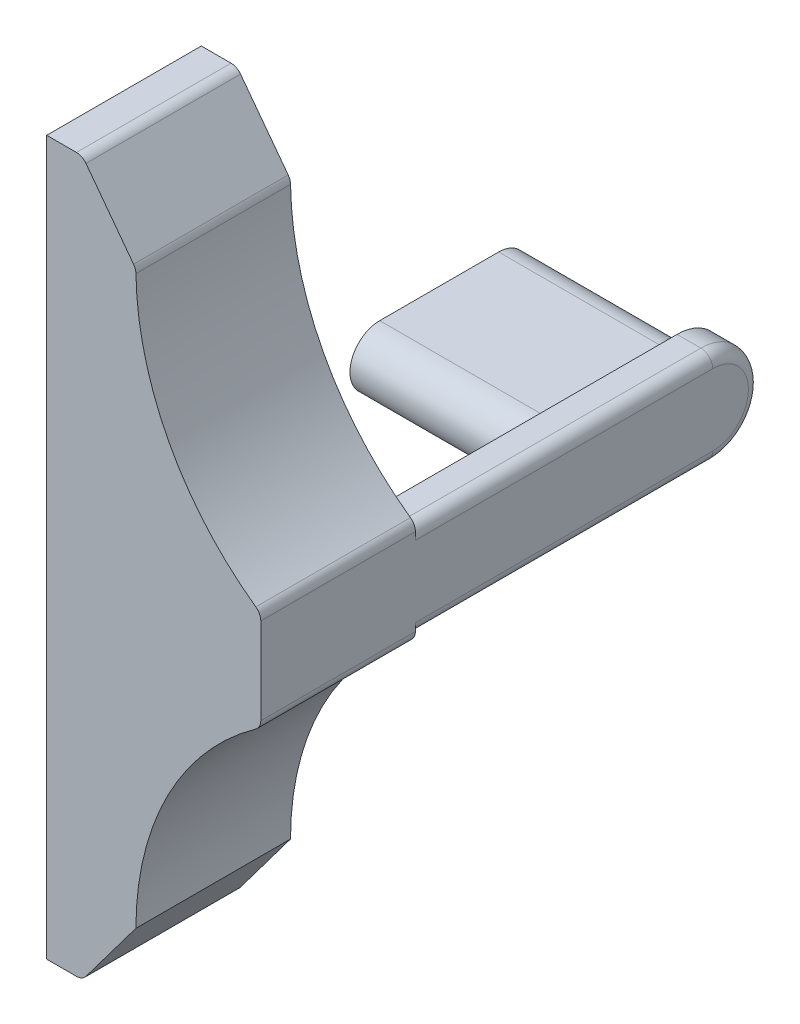
ISO-10303-21;
HEADER;
FILE_DESCRIPTION(('STEP AP214'),'2;1');
FILE_NAME('part.step','',(''),(''),'','','');
FILE_SCHEMA(('AUTOMOTIVE_DESIGN { 1 0 10303 214 1 1 1 1 }'));
ENDSEC;
DATA;
#1=APPLICATION_CONTEXT('core data for automotive mechanical design processes');
#2=APPLICATION_PROTOCOL_DEFINITION('international standard','automotive_design',2000,#1);
#3=PRODUCT_CONTEXT('',#1,'mechanical');
#4=PRODUCT('Part','Part','',(#3));
#5=PRODUCT_RELATED_PRODUCT_CATEGORY('part','',(#4));
#6=PRODUCT_DEFINITION_FORMATION('','',#4);
#7=PRODUCT_DEFINITION_CONTEXT('part definition',#1,'design');
#8=PRODUCT_DEFINITION('design','',#6,#7);
#9=PRODUCT_DEFINITION_SHAPE('','',#8);
#10=(LENGTH_UNIT() NAMED_UNIT(*) SI_UNIT(.MILLI.,.METRE.));
#11=(NAMED_UNIT(*) PLANE_ANGLE_UNIT() SI_UNIT($,.RADIAN.));
#12=(NAMED_UNIT(*) SI_UNIT($,.STERADIAN.) SOLID_ANGLE_UNIT());
#13=UNCERTAINTY_MEASURE_WITH_UNIT(LENGTH_MEASURE(1.E-05),#10,'distance_accuracy_value','');
#14=(GEOMETRIC_REPRESENTATION_CONTEXT(3) GLOBAL_UNCERTAINTY_ASSIGNED_CONTEXT((#13)) GLOBAL_UNIT_ASSIGNED_CONTEXT((#10,
#11,#12)) REPRESENTATION_CONTEXT('',''));
#15=CARTESIAN_POINT('',(0.,0.,0.));
#16=DIRECTION('',(0.,0.,1.));
#17=DIRECTION('',(1.,0.,0.));
#18=AXIS2_PLACEMENT_3D('',#15,#16,#17);
#19=CARTESIAN_POINT('',(7.27889970519868E-12,1.11022302462516E-13,-559.301234579366));
#20=DIRECTION('',(-1.,0.,0.));
#21=DIRECTION('',(0.,0.,1.));
#22=AXIS2_PLACEMENT_3D('',#19,#20,#21);
#23=PLANE('',#22);
#24=DIRECTION('',(0.,0.,-1.));
#25=VECTOR('',#24,1.);
#26=CARTESIAN_POINT('',(9.15240105925363E-12,86.2440750856868,-1.00000000000432));
#27=LINE('',#26,#25);
#28=CARTESIAN_POINT('',(9.15240105925363E-12,86.2440750856868,0.));
#29=VERTEX_POINT('',#28);
#30=CARTESIAN_POINT('',(9.15562617895288E-12,86.2440750856868,-24.9999999999957));
#31=VERTEX_POINT('',#30);
#32=EDGE_CURVE('E235',#29,#31,#27,.T.);
#33=ORIENTED_EDGE('',*,*,#32,.F.);
#34=DIRECTION('',(0.,1.,0.));
#35=VECTOR('',#34,1.);
#36=CARTESIAN_POINT('',(8.71872019025943E-12,66.244075085687,0.));
#37=LINE('',#36,#35);
#38=CARTESIAN_POINT('',(9.32758369762029E-12,94.2440750856868,0.));
#39=VERTEX_POINT('',#38);
#40=EDGE_CURVE('E291',#29,#39,#37,.T.);
#41=ORIENTED_EDGE('',*,*,#40,.T.);
#42=DIRECTION('',(0.,0.,1.));
#43=VECTOR('',#42,1.);
#44=CARTESIAN_POINT('',(9.32587340685131E-12,94.2440750856868,-1.00000000000432));
#45=LINE('',#44,#43);
#46=CARTESIAN_POINT('',(9.15240105925363E-12,94.2440750856868,-24.9999999999957));
#47=VERTEX_POINT('',#46);
#48=EDGE_CURVE('E238',#47,#39,#45,.T.);
#49=ORIENTED_EDGE('',*,*,#48,.F.);
#50=CARTESIAN_POINT('',(9.24260668000443E-12,90.2440750856868,-24.9999999999957));
#51=DIRECTION('',(-1.,0.,0.));
#52=DIRECTION('',(0.,-1.,0.));
#53=AXIS2_PLACEMENT_3D('',#50,#51,#52);
#54=CIRCLE('',#53,4.);
#55=EDGE_CURVE('E217',#31,#47,#54,.F.);
#56=ORIENTED_EDGE('',*,*,#55,.F.);
#57=EDGE_LOOP('',(#33,#41,#49,#56));
#58=FACE_BOUND('',#57,.T.);
#59=DIRECTION('',(0.,0.,1.));
#60=VECTOR('',#59,1.);
#61=CARTESIAN_POINT('',(1.90800590381451E-12,87.7440750856868,-24.9999999999957));
#62=LINE('',#61,#60);
#63=CARTESIAN_POINT('',(1.90800590381451E-12,87.7440750856868,-24.9999999999957));
#64=VERTEX_POINT('',#63);
#65=CARTESIAN_POINT('',(1.90800590381451E-12,87.7440750856868,-14.9999999999957));
#66=VERTEX_POINT('',#65);
#67=EDGE_CURVE('E230',#64,#66,#62,.T.);
#68=ORIENTED_EDGE('',*,*,#67,.F.);
#69=CARTESIAN_POINT('',(1.96236871697173E-12,90.2440750856868,-24.9999999999957));
#70=DIRECTION('',(-1.,0.,0.));
#71=DIRECTION('',(0.,-1.,0.));
#72=AXIS2_PLACEMENT_3D('',#69,#70,#71);
#73=CIRCLE('',#72,2.5);
#74=CARTESIAN_POINT('',(2.01673153012895E-12,92.7440750856868,-24.9999999999957));
#75=VERTEX_POINT('',#74);
#76=EDGE_CURVE('E224',#75,#64,#73,.T.);
#77=ORIENTED_EDGE('',*,*,#76,.F.);
#78=DIRECTION('',(0.,0.,-1.));
#79=VECTOR('',#78,1.);
#80=CARTESIAN_POINT('',(2.01673153012895E-12,92.7440750856868,-14.9999999999957));
#81=LINE('',#80,#79);
#82=CARTESIAN_POINT('',(9.29563123532762E-12,92.7440750856868,-14.9999999999957));
#83=VERTEX_POINT('',#82);
#84=EDGE_CURVE('E203',#83,#75,#81,.T.);
#85=ORIENTED_EDGE('',*,*,#84,.F.);
#86=CARTESIAN_POINT('',(1.96236871697173E-12,90.2440750856868,-14.9999999999957));
#87=DIRECTION('',(-1.,0.,0.));
#88=DIRECTION('',(0.,-1.,0.));
#89=AXIS2_PLACEMENT_3D('',#86,#87,#88);
#90=CIRCLE('',#89,2.5);
#91=EDGE_CURVE('E199',#66,#83,#90,.T.);
#92=ORIENTED_EDGE('',*,*,#91,.F.);
#93=EDGE_LOOP('',(#68,#77,#85,#92));
#94=FACE_BOUND('',#93,.T.);
#95=ADVANCED_FACE('F38',(#58,#94),#23,.T.);
#96=CARTESIAN_POINT('',(16.4999999999923,66.2440750856866,13.));
#97=DIRECTION('',(0.,0.,-1.));
#98=DIRECTION('',(-1.,0.,0.));
#99=AXIS2_PLACEMENT_3D('',#96,#97,#98);
#100=CYLINDRICAL_SURFACE('',#99,24.);
#101=CARTESIAN_POINT('',(16.4999999999923,66.2440750856866,0.));
#102=DIRECTION('',(0.,0.,-1.));
#103=DIRECTION('',(-1.,0.,0.));
#104=AXIS2_PLACEMENT_3D('',#101,#102,#103);
#105=CIRCLE('',#104,24.);
#106=CARTESIAN_POINT('',(-7.50000000000766,66.2440750856866,0.));
#107=VERTEX_POINT('',#106);
#108=CARTESIAN_POINT('',(2.57999999999974,85.7948704659315,0.));
#109=VERTEX_POINT('',#108);
#110=EDGE_CURVE('E245',#107,#109,#105,.T.);
#111=ORIENTED_EDGE('',*,*,#110,.T.);
#112=DIRECTION('',(0.,0.,-1.));
#113=VECTOR('',#112,1.);
#114=CARTESIAN_POINT('',(2.57999999999975,85.7948704659315,13.));
#115=LINE('',#114,#113);
#116=CARTESIAN_POINT('',(2.57999999999974,85.7948704659315,13.));
#117=VERTEX_POINT('',#116);
#118=EDGE_CURVE('E311',#109,#117,#115,.F.);
#119=ORIENTED_EDGE('',*,*,#118,.T.);
#120=CARTESIAN_POINT('',(16.4999999999923,66.2440750856866,13.));
#121=DIRECTION('',(0.,0.,-1.));
#122=DIRECTION('',(-1.,0.,0.));
#123=AXIS2_PLACEMENT_3D('',#120,#121,#122);
#124=CIRCLE('',#123,24.);
#125=CARTESIAN_POINT('',(-7.50000000000766,66.2440750856866,13.));
#126=VERTEX_POINT('',#125);
#127=EDGE_CURVE('E246',#126,#117,#124,.T.);
#128=ORIENTED_EDGE('',*,*,#127,.F.);
#129=DIRECTION('',(0.,0.,-1.));
#130=VECTOR('',#129,1.);
#131=CARTESIAN_POINT('',(-7.50000000000766,66.2440750856866,13.));
#132=LINE('',#131,#130);
#133=EDGE_CURVE('E266',#126,#107,#132,.T.);
#134=ORIENTED_EDGE('',*,*,#133,.T.);
#135=EDGE_LOOP('',(#111,#119,#128,#134));
#136=FACE_BOUND('',#135,.T.);
#137=ADVANCED_FACE('F408',(#136),#100,.F.);
#138=CARTESIAN_POINT('',(3.00000000000005,94.4009402526969,13.));
#139=DIRECTION('',(-1.,0.,0.));
#140=DIRECTION('',(0.,0.,1.));
#141=AXIS2_PLACEMENT_3D('',#138,#139,#140);
#142=PLANE('',#141);
#143=DIRECTION('',(0.,0.,-1.));
#144=VECTOR('',#143,1.);
#145=CARTESIAN_POINT('',(3.00000000000005,86.6094869401084,13.));
#146=LINE('',#145,#144);
#147=CARTESIAN_POINT('',(3.00000000000005,86.6094869401084,13.));
#148=VERTEX_POINT('',#147);
#149=CARTESIAN_POINT('',(3.00000000000005,86.6094869401084,0.));
#150=VERTEX_POINT('',#149);
#151=EDGE_CURVE('E306',#148,#150,#146,.T.);
#152=ORIENTED_EDGE('',*,*,#151,.T.);
#153=DIRECTION('',(0.,1.,0.));
#154=VECTOR('',#153,1.);
#155=CARTESIAN_POINT('',(3.00000000000005,66.2440750856866,0.));
#156=LINE('',#155,#154);
#157=CARTESIAN_POINT('',(3.00000000000005,87.2440750856868,0.));
#158=VERTEX_POINT('',#157);
#159=EDGE_CURVE('E328',#150,#158,#156,.T.);
#160=ORIENTED_EDGE('',*,*,#159,.T.);
#161=DIRECTION('',(0.,0.,1.));
#162=VECTOR('',#161,1.);
#163=CARTESIAN_POINT('',(3.00000000000005,87.2440750856868,-24.9999999999957));
#164=LINE('',#163,#162);
#165=CARTESIAN_POINT('',(3.00000000000005,87.2440750856868,-24.9999999999957));
#166=VERTEX_POINT('',#165);
#167=EDGE_CURVE('E326',#158,#166,#164,.F.);
#168=ORIENTED_EDGE('',*,*,#167,.T.);
#169=CARTESIAN_POINT('',(3.00000000000005,90.2440750856868,-24.9999999999957));
#170=DIRECTION('',(-1.,0.,0.));
#171=DIRECTION('',(0.,0.,1.));
#172=AXIS2_PLACEMENT_3D('',#169,#170,#171);
#173=CIRCLE('',#172,3.);
#174=CARTESIAN_POINT('',(3.00000000000005,93.2440750856868,-24.9999999999957));
#175=VERTEX_POINT('',#174);
#176=EDGE_CURVE('E324',#166,#175,#173,.F.);
#177=ORIENTED_EDGE('',*,*,#176,.T.);
#178=DIRECTION('',(0.,0.,-1.));
#179=VECTOR('',#178,1.);
#180=CARTESIAN_POINT('',(3.00000000000005,93.2440750856868,0.));
#181=LINE('',#180,#179);
#182=CARTESIAN_POINT('',(3.00000000000005,93.2440750856868,0.));
#183=VERTEX_POINT('',#182);
#184=EDGE_CURVE('E321',#175,#183,#181,.F.);
#185=ORIENTED_EDGE('',*,*,#184,.T.);
#186=DIRECTION('',(0.,1.,0.));
#187=VECTOR('',#186,1.);
#188=CARTESIAN_POINT('',(3.00000000000005,66.2440750856866,0.));
#189=LINE('',#188,#187);
#190=CARTESIAN_POINT('',(3.00000000000005,93.8786632312648,0.));
#191=VERTEX_POINT('',#190);
#192=EDGE_CURVE('E318',#183,#191,#189,.T.);
#193=ORIENTED_EDGE('',*,*,#192,.T.);
#194=DIRECTION('',(0.,0.,-1.));
#195=VECTOR('',#194,1.);
#196=CARTESIAN_POINT('',(3.00000000000005,93.8786632312648,13.));
#197=LINE('',#196,#195);
#198=CARTESIAN_POINT('',(3.00000000000005,93.8786632312648,13.));
#199=VERTEX_POINT('',#198);
#200=EDGE_CURVE('E302',#191,#199,#197,.F.);
#201=ORIENTED_EDGE('',*,*,#200,.T.);
#202=DIRECTION('',(0.,1.,0.));
#203=VECTOR('',#202,1.);
#204=CARTESIAN_POINT('',(3.00000000000005,94.4009402526969,13.));
#205=LINE('',#204,#203);
#206=EDGE_CURVE('E249',#148,#199,#205,.T.);
#207=ORIENTED_EDGE('',*,*,#206,.F.);
#208=EDGE_LOOP('',(#152,#160,#168,#177,#185,#193,#201,#207));
#209=FACE_BOUND('',#208,.T.);
#210=ADVANCED_FACE('F417',(#209),#142,.F.);
#211=CARTESIAN_POINT('',(16.4999999999923,114.244075085687,13.));
#212=DIRECTION('',(0.,0.,-1.));
#213=DIRECTION('',(-1.,0.,0.));
#214=AXIS2_PLACEMENT_3D('',#211,#212,#213);
#215=CYLINDRICAL_SURFACE('',#214,24.);
#216=CARTESIAN_POINT('',(16.4999999999923,114.244075085687,0.));
#217=DIRECTION('',(0.,0.,-1.));
#218=DIRECTION('',(1.,0.,0.));
#219=AXIS2_PLACEMENT_3D('',#216,#217,#218);
#220=CIRCLE('',#219,24.);
#221=CARTESIAN_POINT('',(2.57999999999974,94.6932797054417,0.));
#222=VERTEX_POINT('',#221);
#223=CARTESIAN_POINT('',(-7.49782777629939,113.921178787409,0.));
#224=VERTEX_POINT('',#223);
#225=EDGE_CURVE('E269',#222,#224,#220,.T.);
#226=ORIENTED_EDGE('',*,*,#225,.T.);
#227=DIRECTION('',(0.,0.,-1.));
#228=VECTOR('',#227,1.);
#229=CARTESIAN_POINT('',(-7.49782777629939,113.921178787409,13.));
#230=LINE('',#229,#228);
#231=CARTESIAN_POINT('',(-7.49782777629939,113.921178787409,13.));
#232=VERTEX_POINT('',#231);
#233=EDGE_CURVE('E46',#224,#232,#230,.F.);
#234=ORIENTED_EDGE('',*,*,#233,.T.);
#235=CARTESIAN_POINT('',(16.4999999999923,114.244075085687,13.));
#236=DIRECTION('',(0.,0.,-1.));
#237=DIRECTION('',(1.,0.,0.));
#238=AXIS2_PLACEMENT_3D('',#235,#236,#237);
#239=CIRCLE('',#238,24.);
#240=CARTESIAN_POINT('',(2.57999999999974,94.6932797054417,13.));
#241=VERTEX_POINT('',#240);
#242=EDGE_CURVE('E253',#241,#232,#239,.T.);
#243=ORIENTED_EDGE('',*,*,#242,.F.);
#244=DIRECTION('',(0.,0.,-1.));
#245=VECTOR('',#244,1.);
#246=CARTESIAN_POINT('',(2.57999999999975,94.6932797054417,13.));
#247=LINE('',#246,#245);
#248=EDGE_CURVE('E297',#241,#222,#247,.T.);
#249=ORIENTED_EDGE('',*,*,#248,.T.);
#250=EDGE_LOOP('',(#226,#234,#243,#249));
#251=FACE_BOUND('',#250,.T.);
#252=ADVANCED_FACE('F422',(#251),#215,.F.);
#253=CARTESIAN_POINT('',(-7.50000000000766,114.244075085687,13.));
#254=DIRECTION('',(-0.80000000000047,-0.599999999999373,0.));
#255=DIRECTION('',(0.599999999999373,-0.80000000000047,0.));
#256=AXIS2_PLACEMENT_3D('',#253,#254,#255);
#257=PLANE('',#256);
#258=DIRECTION('',(-0.599999999999373,0.80000000000047,0.));
#259=VECTOR('',#258,1.);
#260=CARTESIAN_POINT('',(-7.50000000000766,114.244075085687,13.));
#261=LINE('',#260,#259);
#262=CARTESIAN_POINT('',(-7.69773726697774,114.50772477498,13.));
#263=VERTEX_POINT('',#262);
#264=CARTESIAN_POINT('',(-11.7000000000004,119.844075085686,13.));
#265=VERTEX_POINT('',#264);
#266=EDGE_CURVE('E255',#263,#265,#261,.T.);
#267=ORIENTED_EDGE('',*,*,#266,.F.);
#268=DIRECTION('',(0.,0.,-1.));
#269=VECTOR('',#268,1.);
#270=CARTESIAN_POINT('',(-7.69773726697774,114.50772477498,13.));
#271=LINE('',#270,#269);
#272=CARTESIAN_POINT('',(-7.69773726697774,114.50772477498,0.));
#273=VERTEX_POINT('',#272);
#274=EDGE_CURVE('E364',#263,#273,#271,.T.);
#275=ORIENTED_EDGE('',*,*,#274,.T.);
#276=DIRECTION('',(-0.599999999999373,0.80000000000047,0.));
#277=VECTOR('',#276,1.);
#278=CARTESIAN_POINT('',(-7.50000000000766,114.244075085687,0.));
#279=LINE('',#278,#277);
#280=CARTESIAN_POINT('',(-11.7000000000004,119.844075085686,0.));
#281=VERTEX_POINT('',#280);
#282=EDGE_CURVE('E271',#273,#281,#279,.T.);
#283=ORIENTED_EDGE('',*,*,#282,.T.);
#284=DIRECTION('',(0.,0.,-1.));
#285=VECTOR('',#284,1.);
#286=CARTESIAN_POINT('',(-11.7000000000004,119.844075085686,13.));
#287=LINE('',#286,#285);
#288=EDGE_CURVE('E359',#281,#265,#287,.F.);
#289=ORIENTED_EDGE('',*,*,#288,.T.);
#290=EDGE_LOOP('',(#267,#275,#283,#289));
#291=FACE_BOUND('',#290,.T.);
#292=ADVANCED_FACE('F370',(#291),#257,.F.);
#293=CARTESIAN_POINT('',(-12.0000000000004,120.244075085687,13.));
#294=DIRECTION('',(0.,-1.,0.));
#295=DIRECTION('',(1.,0.,0.));
#296=AXIS2_PLACEMENT_3D('',#293,#294,#295);
#297=PLANE('',#296);
#298=DIRECTION('',(-1.,0.,0.));
#299=VECTOR('',#298,1.);
#300=CARTESIAN_POINT('',(-12.0000000000004,120.244075085687,13.));
#301=LINE('',#300,#299);
#302=CARTESIAN_POINT('',(-12.5000000000009,120.244075085687,13.));
#303=VERTEX_POINT('',#302);
#304=CARTESIAN_POINT('',(-15.0000000000077,120.244075085687,13.));
#305=VERTEX_POINT('',#304);
#306=EDGE_CURVE('E257',#303,#305,#301,.T.);
#307=ORIENTED_EDGE('',*,*,#306,.F.);
#308=DIRECTION('',(0.,0.,-1.));
#309=VECTOR('',#308,1.);
#310=CARTESIAN_POINT('',(-12.5000000000009,120.244075085687,13.));
#311=LINE('',#310,#309);
#312=CARTESIAN_POINT('',(-12.5000000000009,120.244075085687,0.));
#313=VERTEX_POINT('',#312);
#314=EDGE_CURVE('E353',#303,#313,#311,.T.);
#315=ORIENTED_EDGE('',*,*,#314,.T.);
#316=DIRECTION('',(-1.,0.,0.));
#317=VECTOR('',#316,1.);
#318=CARTESIAN_POINT('',(-12.0000000000004,120.244075085687,0.));
#319=LINE('',#318,#317);
#320=CARTESIAN_POINT('',(-15.0000000000077,120.244075085687,0.));
#321=VERTEX_POINT('',#320);
#322=EDGE_CURVE('E273',#313,#321,#319,.T.);
#323=ORIENTED_EDGE('',*,*,#322,.T.);
#324=DIRECTION('',(0.,0.,-1.));
#325=VECTOR('',#324,1.);
#326=CARTESIAN_POINT('',(-15.0000000000077,120.244075085687,13.));
#327=LINE('',#326,#325);
#328=EDGE_CURVE('E286',#305,#321,#327,.T.);
#329=ORIENTED_EDGE('',*,*,#328,.F.);
#330=EDGE_LOOP('',(#307,#315,#323,#329));
#331=FACE_BOUND('',#330,.T.);
#332=ADVANCED_FACE('F386',(#331),#297,.F.);
#333=CARTESIAN_POINT('',(-15.0000000000077,120.244075085687,13.));
#334=DIRECTION('',(1.,0.,0.));
#335=DIRECTION('',(0.,0.,-1.));
#336=AXIS2_PLACEMENT_3D('',#333,#334,#335);
#337=PLANE('',#336);
#338=DIRECTION('',(0.,-1.,0.));
#339=VECTOR('',#338,1.);
#340=CARTESIAN_POINT('',(-15.0000000000077,120.244075085687,0.));
#341=LINE('',#340,#339);
#342=CARTESIAN_POINT('',(-15.0000000000077,60.2440750856866,0.));
#343=VERTEX_POINT('',#342);
#344=EDGE_CURVE('E275',#321,#343,#341,.T.);
#345=ORIENTED_EDGE('',*,*,#344,.T.);
#346=DIRECTION('',(0.,0.,-1.));
#347=VECTOR('',#346,1.);
#348=CARTESIAN_POINT('',(-15.0000000000077,60.2440750856866,13.));
#349=LINE('',#348,#347);
#350=CARTESIAN_POINT('',(-15.0000000000077,60.2440750856866,13.));
#351=VERTEX_POINT('',#350);
#352=EDGE_CURVE('E283',#351,#343,#349,.T.);
#353=ORIENTED_EDGE('',*,*,#352,.F.);
#354=DIRECTION('',(0.,-1.,0.));
#355=VECTOR('',#354,1.);
#356=CARTESIAN_POINT('',(-15.0000000000077,120.244075085687,13.));
#357=LINE('',#356,#355);
#358=EDGE_CURVE('E259',#305,#351,#357,.T.);
#359=ORIENTED_EDGE('',*,*,#358,.F.);
#360=ORIENTED_EDGE('',*,*,#328,.T.);
#361=EDGE_LOOP('',(#345,#353,#359,#360));
#362=FACE_BOUND('',#361,.T.);
#363=ADVANCED_FACE('F390',(#362),#337,.F.);
#364=CARTESIAN_POINT('',(-12.0000000000004,60.2440750856867,13.));
#365=DIRECTION('',(0.,1.,0.));
#366=DIRECTION('',(-1.,0.,0.));
#367=AXIS2_PLACEMENT_3D('',#364,#365,#366);
#368=PLANE('',#367);
#369=DIRECTION('',(1.,0.,0.));
#370=VECTOR('',#369,1.);
#371=CARTESIAN_POINT('',(-12.0000000000004,60.2440750856867,0.));
#372=LINE('',#371,#370);
#373=CARTESIAN_POINT('',(-12.5000000000008,60.2440750856867,0.));
#374=VERTEX_POINT('',#373);
#375=EDGE_CURVE('E277',#343,#374,#372,.T.);
#376=ORIENTED_EDGE('',*,*,#375,.T.);
#377=DIRECTION('',(0.,0.,-1.));
#378=VECTOR('',#377,1.);
#379=CARTESIAN_POINT('',(-12.5000000000008,60.2440750856867,13.));
#380=LINE('',#379,#378);
#381=CARTESIAN_POINT('',(-12.5000000000008,60.2440750856867,13.));
#382=VERTEX_POINT('',#381);
#383=EDGE_CURVE('E349',#374,#382,#380,.F.);
#384=ORIENTED_EDGE('',*,*,#383,.T.);
#385=DIRECTION('',(1.,0.,0.));
#386=VECTOR('',#385,1.);
#387=CARTESIAN_POINT('',(-12.0000000000004,60.2440750856867,13.));
#388=LINE('',#387,#386);
#389=EDGE_CURVE('E261',#351,#382,#388,.T.);
#390=ORIENTED_EDGE('',*,*,#389,.F.);
#391=ORIENTED_EDGE('',*,*,#352,.T.);
#392=EDGE_LOOP('',(#376,#384,#390,#391));
#393=FACE_BOUND('',#392,.T.);
#394=ADVANCED_FACE('F475',(#393),#368,.F.);
#395=CARTESIAN_POINT('',(-7.50000000000766,66.2440750856866,13.));
#396=DIRECTION('',(-0.800000000000462,0.599999999999384,0.));
#397=DIRECTION('',(-0.599999999999384,-0.800000000000462,0.));
#398=AXIS2_PLACEMENT_3D('',#395,#396,#397);
#399=PLANE('',#398);
#400=DIRECTION('',(0.599999999999384,0.800000000000462,0.));
#401=VECTOR('',#400,1.);
#402=CARTESIAN_POINT('',(-7.50000000000766,66.2440750856866,13.));
#403=LINE('',#402,#401);
#404=CARTESIAN_POINT('',(-11.7000000000004,60.6440750856873,13.));
#405=VERTEX_POINT('',#404);
#406=EDGE_CURVE('E264',#405,#126,#403,.T.);
#407=ORIENTED_EDGE('',*,*,#406,.F.);
#408=DIRECTION('',(0.,0.,-1.));
#409=VECTOR('',#408,1.);
#410=CARTESIAN_POINT('',(-11.7000000000004,60.6440750856873,13.));
#411=LINE('',#410,#409);
#412=CARTESIAN_POINT('',(-11.7000000000004,60.6440750856873,0.));
#413=VERTEX_POINT('',#412);
#414=EDGE_CURVE('E339',#405,#413,#411,.T.);
#415=ORIENTED_EDGE('',*,*,#414,.T.);
#416=DIRECTION('',(0.599999999999384,0.800000000000462,0.));
#417=VECTOR('',#416,1.);
#418=CARTESIAN_POINT('',(-7.50000000000766,66.2440750856866,0.));
#419=LINE('',#418,#417);
#420=EDGE_CURVE('E250',#413,#107,#419,.T.);
#421=ORIENTED_EDGE('',*,*,#420,.T.);
#422=ORIENTED_EDGE('',*,*,#133,.F.);
#423=EDGE_LOOP('',(#407,#415,#421,#422));
#424=FACE_BOUND('',#423,.T.);
#425=ADVANCED_FACE('F401',(#424),#399,.F.);
#426=CARTESIAN_POINT('',(16.4999999999923,66.2440750856866,13.));
#427=DIRECTION('',(0.,0.,-1.));
#428=DIRECTION('',(-1.,0.,0.));
#429=AXIS2_PLACEMENT_3D('',#426,#427,#428);
#430=PLANE('',#429);
#431=ORIENTED_EDGE('',*,*,#242,.T.);
#432=CARTESIAN_POINT('',(-8.49773726697821,113.907724774981,13.));
#433=DIRECTION('',(0.,0.,-1.));
#434=DIRECTION('',(-1.,0.,0.));
#435=AXIS2_PLACEMENT_3D('',#432,#433,#434);
#436=CIRCLE('',#435,1.);
#437=EDGE_CURVE('E11',#232,#263,#436,.F.);
#438=ORIENTED_EDGE('',*,*,#437,.T.);
#439=ORIENTED_EDGE('',*,*,#266,.T.);
#440=CARTESIAN_POINT('',(-12.5000000000009,119.244075085687,13.));
#441=DIRECTION('',(0.,0.,-1.));
#442=DIRECTION('',(-1.,0.,0.));
#443=AXIS2_PLACEMENT_3D('',#440,#441,#442);
#444=CIRCLE('',#443,1.);
#445=EDGE_CURVE('E362',#265,#303,#444,.F.);
#446=ORIENTED_EDGE('',*,*,#445,.T.);
#447=ORIENTED_EDGE('',*,*,#306,.T.);
#448=ORIENTED_EDGE('',*,*,#358,.T.);
#449=ORIENTED_EDGE('',*,*,#389,.T.);
#450=CARTESIAN_POINT('',(-12.5000000000009,61.2440750856867,13.));
#451=DIRECTION('',(0.,0.,-1.));
#452=DIRECTION('',(-1.,0.,0.));
#453=AXIS2_PLACEMENT_3D('',#450,#451,#452);
#454=CIRCLE('',#453,1.);
#455=EDGE_CURVE('E351',#382,#405,#454,.F.);
#456=ORIENTED_EDGE('',*,*,#455,.T.);
#457=ORIENTED_EDGE('',*,*,#406,.T.);
#458=ORIENTED_EDGE('',*,*,#127,.T.);
#459=CARTESIAN_POINT('',(2.00000000000006,86.6094869401084,13.));
#460=DIRECTION('',(0.,0.,-1.));
#461=DIRECTION('',(-1.,0.,0.));
#462=AXIS2_PLACEMENT_3D('',#459,#460,#461);
#463=CIRCLE('',#462,1.);
#464=EDGE_CURVE('E313',#117,#148,#463,.F.);
#465=ORIENTED_EDGE('',*,*,#464,.T.);
#466=ORIENTED_EDGE('',*,*,#206,.T.);
#467=CARTESIAN_POINT('',(2.00000000000006,93.8786632312648,13.));
#468=DIRECTION('',(0.,0.,-1.));
#469=DIRECTION('',(-1.,0.,0.));
#470=AXIS2_PLACEMENT_3D('',#467,#468,#469);
#471=CIRCLE('',#470,1.);
#472=EDGE_CURVE('E304',#199,#241,#471,.F.);
#473=ORIENTED_EDGE('',*,*,#472,.T.);
#474=EDGE_LOOP('',(#431,#438,#439,#446,#447,#448,#449,#456,#457,#458,#465,#466,#473));
#475=FACE_BOUND('',#474,.T.);
#476=ADVANCED_FACE('F383',(#475),#430,.F.);
#477=CARTESIAN_POINT('',(16.4999999999923,66.2440750856866,0.));
#478=DIRECTION('',(0.,0.,-1.));
#479=DIRECTION('',(-1.,0.,0.));
#480=AXIS2_PLACEMENT_3D('',#477,#478,#479);
#481=PLANE('',#480);
#482=ORIENTED_EDGE('',*,*,#282,.F.);
#483=CARTESIAN_POINT('',(-8.49773726697821,113.907724774981,0.));
#484=DIRECTION('',(0.,0.,-1.));
#485=DIRECTION('',(-1.,0.,0.));
#486=AXIS2_PLACEMENT_3D('',#483,#484,#485);
#487=CIRCLE('',#486,1.);
#488=EDGE_CURVE('E60',#273,#224,#487,.T.);
#489=ORIENTED_EDGE('',*,*,#488,.T.);
#490=ORIENTED_EDGE('',*,*,#225,.F.);
#491=CARTESIAN_POINT('',(2.00000000000006,93.8786632312648,0.));
#492=DIRECTION('',(0.,0.,-1.));
#493=DIRECTION('',(-1.,0.,0.));
#494=AXIS2_PLACEMENT_3D('',#491,#492,#493);
#495=CIRCLE('',#494,1.);
#496=EDGE_CURVE('E300',#222,#191,#495,.T.);
#497=ORIENTED_EDGE('',*,*,#496,.T.);
#498=ORIENTED_EDGE('',*,*,#192,.F.);
#499=CARTESIAN_POINT('',(2.00000000000005,93.2440750856868,0.));
#500=DIRECTION('',(0.,0.,-1.));
#501=DIRECTION('',(-1.,0.,0.));
#502=AXIS2_PLACEMENT_3D('',#499,#500,#501);
#503=CIRCLE('',#502,1.);
#504=CARTESIAN_POINT('',(2.00000000000005,94.2440750856868,0.));
#505=VERTEX_POINT('',#504);
#506=EDGE_CURVE('E337',#183,#505,#503,.F.);
#507=ORIENTED_EDGE('',*,*,#506,.T.);
#508=DIRECTION('',(1.,0.,0.));
#509=VECTOR('',#508,1.);
#510=CARTESIAN_POINT('',(16.4999999999923,94.2440750856868,0.));
#511=LINE('',#510,#509);
#512=EDGE_CURVE('E294',#39,#505,#511,.T.);
#513=ORIENTED_EDGE('',*,*,#512,.F.);
#514=ORIENTED_EDGE('',*,*,#40,.F.);
#515=DIRECTION('',(-1.,0.,0.));
#516=VECTOR('',#515,1.);
#517=CARTESIAN_POINT('',(16.4999999999923,86.2440750856868,0.));
#518=LINE('',#517,#516);
#519=CARTESIAN_POINT('',(2.00000000000005,86.2440750856868,0.));
#520=VERTEX_POINT('',#519);
#521=EDGE_CURVE('E289',#520,#29,#518,.T.);
#522=ORIENTED_EDGE('',*,*,#521,.F.);
#523=CARTESIAN_POINT('',(2.00000000000005,87.2440750856868,0.));
#524=DIRECTION('',(0.,0.,-1.));
#525=DIRECTION('',(-1.,0.,0.));
#526=AXIS2_PLACEMENT_3D('',#523,#524,#525);
#527=CIRCLE('',#526,1.);
#528=EDGE_CURVE('E335',#520,#158,#527,.F.);
#529=ORIENTED_EDGE('',*,*,#528,.T.);
#530=ORIENTED_EDGE('',*,*,#159,.F.);
#531=CARTESIAN_POINT('',(2.00000000000006,86.6094869401084,0.));
#532=DIRECTION('',(0.,0.,-1.));
#533=DIRECTION('',(-1.,0.,0.));
#534=AXIS2_PLACEMENT_3D('',#531,#532,#533);
#535=CIRCLE('',#534,1.);
#536=EDGE_CURVE('E309',#150,#109,#535,.T.);
#537=ORIENTED_EDGE('',*,*,#536,.T.);
#538=ORIENTED_EDGE('',*,*,#110,.F.);
#539=ORIENTED_EDGE('',*,*,#420,.F.);
#540=CARTESIAN_POINT('',(-12.5000000000009,61.2440750856867,0.));
#541=DIRECTION('',(0.,0.,-1.));
#542=DIRECTION('',(-1.,0.,0.));
#543=AXIS2_PLACEMENT_3D('',#540,#541,#542);
#544=CIRCLE('',#543,1.);
#545=EDGE_CURVE('E347',#413,#374,#544,.T.);
#546=ORIENTED_EDGE('',*,*,#545,.T.);
#547=ORIENTED_EDGE('',*,*,#375,.F.);
#548=ORIENTED_EDGE('',*,*,#344,.F.);
#549=ORIENTED_EDGE('',*,*,#322,.F.);
#550=CARTESIAN_POINT('',(-12.5000000000009,119.244075085687,0.));
#551=DIRECTION('',(0.,0.,-1.));
#552=DIRECTION('',(-1.,0.,0.));
#553=AXIS2_PLACEMENT_3D('',#550,#551,#552);
#554=CIRCLE('',#553,1.);
#555=EDGE_CURVE('E356',#313,#281,#554,.T.);
#556=ORIENTED_EDGE('',*,*,#555,.T.);
#557=EDGE_LOOP('',(#482,#489,#490,#497,#498,#507,#513,#514,#522,#529,#530,#537,#538,#539,#546,
#547,#548,#549,#556));
#558=FACE_BOUND('',#557,.T.);
#559=ADVANCED_FACE('F373',(#558),#481,.T.);
#560=CARTESIAN_POINT('',(-42.7551166528462,90.2440750856868,-24.9999999999957));
#561=DIRECTION('',(1.,0.,0.));
#562=DIRECTION('',(0.,0.,-1.));
#563=AXIS2_PLACEMENT_3D('',#560,#561,#562);
#564=CYLINDRICAL_SURFACE('',#563,4.);
#565=DIRECTION('',(1.,0.,0.));
#566=VECTOR('',#565,1.);
#567=CARTESIAN_POINT('',(-42.7551166528462,94.2440750856868,-24.9999999999957));
#568=LINE('',#567,#566);
#569=CARTESIAN_POINT('',(2.00000000000005,94.2440750856868,-24.9999999999957));
#570=VERTEX_POINT('',#569);
#571=EDGE_CURVE('E220',#47,#570,#568,.T.);
#572=ORIENTED_EDGE('',*,*,#571,.T.);
#573=CARTESIAN_POINT('',(2.00000000000005,90.2440750856868,-24.9999999999957));
#574=DIRECTION('',(-1.,0.,0.));
#575=DIRECTION('',(0.,0.,1.));
#576=AXIS2_PLACEMENT_3D('',#573,#574,#575);
#577=CIRCLE('',#576,4.);
#578=CARTESIAN_POINT('',(2.00000000000005,86.2440750856868,-24.9999999999957));
#579=VERTEX_POINT('',#578);
#580=EDGE_CURVE('E331',#570,#579,#577,.T.);
#581=ORIENTED_EDGE('',*,*,#580,.T.);
#582=DIRECTION('',(1.,0.,0.));
#583=VECTOR('',#582,1.);
#584=CARTESIAN_POINT('',(-42.7551166528462,86.2440750856868,-24.9999999999957));
#585=LINE('',#584,#583);
#586=EDGE_CURVE('E237',#31,#579,#585,.T.);
#587=ORIENTED_EDGE('',*,*,#586,.F.);
#588=ORIENTED_EDGE('',*,*,#55,.T.);
#589=EDGE_LOOP('',(#572,#581,#587,#588));
#590=FACE_BOUND('',#589,.T.);
#591=ADVANCED_FACE('F435',(#590),#564,.T.);
#592=CARTESIAN_POINT('',(-42.7551166528462,94.2440750856868,-1.00000000000432));
#593=DIRECTION('',(0.,1.,0.));
#594=DIRECTION('',(0.,0.,1.));
#595=AXIS2_PLACEMENT_3D('',#592,#593,#594);
#596=PLANE('',#595);
#597=ORIENTED_EDGE('',*,*,#512,.T.);
#598=DIRECTION('',(0.,0.,-1.));
#599=VECTOR('',#598,1.);
#600=CARTESIAN_POINT('',(2.00000000000005,94.2440750856868,-24.9999999999957));
#601=LINE('',#600,#599);
#602=EDGE_CURVE('E333',#505,#570,#601,.T.);
#603=ORIENTED_EDGE('',*,*,#602,.T.);
#604=ORIENTED_EDGE('',*,*,#571,.F.);
#605=ORIENTED_EDGE('',*,*,#48,.T.);
#606=EDGE_LOOP('',(#597,#603,#604,#605));
#607=FACE_BOUND('',#606,.T.);
#608=ADVANCED_FACE('F433',(#607),#596,.T.);
#609=CARTESIAN_POINT('',(-42.7551166528462,86.2440750856868,-1.00000000000432));
#610=DIRECTION('',(0.,-1.,0.));
#611=DIRECTION('',(0.,0.,-1.));
#612=AXIS2_PLACEMENT_3D('',#609,#610,#611);
#613=PLANE('',#612);
#614=ORIENTED_EDGE('',*,*,#586,.T.);
#615=DIRECTION('',(0.,0.,1.));
#616=VECTOR('',#615,1.);
#617=CARTESIAN_POINT('',(2.00000000000005,86.2440750856868,0.));
#618=LINE('',#617,#616);
#619=EDGE_CURVE('E315',#579,#520,#618,.T.);
#620=ORIENTED_EDGE('',*,*,#619,.T.);
#621=ORIENTED_EDGE('',*,*,#521,.T.);
#622=ORIENTED_EDGE('',*,*,#32,.T.);
#623=EDGE_LOOP('',(#614,#620,#621,#622));
#624=FACE_BOUND('',#623,.T.);
#625=ADVANCED_FACE('F444',(#624),#613,.T.);
#626=CARTESIAN_POINT('',(-30.8113883008327,90.2440750856875,-24.9999999999957));
#627=DIRECTION('',(1.,0.,0.));
#628=DIRECTION('',(0.,1.,0.));
#629=AXIS2_PLACEMENT_3D('',#626,#627,#628);
#630=CYLINDRICAL_SURFACE('',#629,2.5);
#631=CARTESIAN_POINT('',(-14.9999999999908,90.2440750856871,-24.9999999999957));
#632=DIRECTION('',(-1.,0.,0.));
#633=DIRECTION('',(0.,-1.,0.));
#634=AXIS2_PLACEMENT_3D('',#631,#632,#633);
#635=CIRCLE('',#634,2.5);
#636=CARTESIAN_POINT('',(-14.9999999999907,92.7440750856871,-24.9999999999957));
#637=VERTEX_POINT('',#636);
#638=CARTESIAN_POINT('',(-14.9999999999908,87.7440750856871,-24.9999999999957));
#639=VERTEX_POINT('',#638);
#640=EDGE_CURVE('E212',#637,#639,#635,.T.);
#641=ORIENTED_EDGE('',*,*,#640,.F.);
#642=DIRECTION('',(1.,0.,0.));
#643=VECTOR('',#642,1.);
#644=CARTESIAN_POINT('',(-30.8113883008326,92.7440750856875,-24.9999999999957));
#645=LINE('',#644,#643);
#646=EDGE_CURVE('E208',#637,#75,#645,.T.);
#647=ORIENTED_EDGE('',*,*,#646,.T.);
#648=ORIENTED_EDGE('',*,*,#76,.T.);
#649=DIRECTION('',(1.,0.,0.));
#650=VECTOR('',#649,1.);
#651=CARTESIAN_POINT('',(-30.8113883008327,87.7440750856875,-24.9999999999957));
#652=LINE('',#651,#650);
#653=EDGE_CURVE('E228',#639,#64,#652,.T.);
#654=ORIENTED_EDGE('',*,*,#653,.F.);
#655=EDGE_LOOP('',(#641,#647,#648,#654));
#656=FACE_BOUND('',#655,.T.);
#657=ADVANCED_FACE('F639',(#656),#630,.T.);
#658=CARTESIAN_POINT('',(-30.8113883008327,87.7440750856875,-24.9999999999957));
#659=DIRECTION('',(0.,1.,0.));
#660=DIRECTION('',(-1.,0.,0.));
#661=AXIS2_PLACEMENT_3D('',#658,#659,#660);
#662=PLANE('',#661);
#663=DIRECTION('',(0.,0.,1.));
#664=VECTOR('',#663,1.);
#665=CARTESIAN_POINT('',(-14.9999999999908,87.7440750856871,-24.9999999999957));
#666=LINE('',#665,#664);
#667=CARTESIAN_POINT('',(-14.9999999999908,87.7440750856871,-14.9999999999957));
#668=VERTEX_POINT('',#667);
#669=EDGE_CURVE('E216',#639,#668,#666,.T.);
#670=ORIENTED_EDGE('',*,*,#669,.F.);
#671=ORIENTED_EDGE('',*,*,#653,.T.);
#672=ORIENTED_EDGE('',*,*,#67,.T.);
#673=DIRECTION('',(1.,0.,0.));
#674=VECTOR('',#673,1.);
#675=CARTESIAN_POINT('',(-30.8113883008327,87.7440750856875,-14.9999999999957));
#676=LINE('',#675,#674);
#677=EDGE_CURVE('E231',#668,#66,#676,.T.);
#678=ORIENTED_EDGE('',*,*,#677,.F.);
#679=EDGE_LOOP('',(#670,#671,#672,#678));
#680=FACE_BOUND('',#679,.T.);
#681=ADVANCED_FACE('F630',(#680),#662,.F.);
#682=CARTESIAN_POINT('',(-30.8113883008327,90.2440750856875,-14.9999999999957));
#683=DIRECTION('',(1.,0.,0.));
#684=DIRECTION('',(0.,1.,0.));
#685=AXIS2_PLACEMENT_3D('',#682,#683,#684);
#686=CYLINDRICAL_SURFACE('',#685,2.5);
#687=CARTESIAN_POINT('',(-14.9999999999908,90.2440750856871,-14.9999999999957));
#688=DIRECTION('',(-1.,0.,0.));
#689=DIRECTION('',(0.,-1.,0.));
#690=AXIS2_PLACEMENT_3D('',#687,#688,#689);
#691=CIRCLE('',#690,2.5);
#692=CARTESIAN_POINT('',(-14.9999999999907,92.7440750856871,-14.9999999999957));
#693=VERTEX_POINT('',#692);
#694=EDGE_CURVE('E196',#668,#693,#691,.T.);
#695=ORIENTED_EDGE('',*,*,#694,.F.);
#696=ORIENTED_EDGE('',*,*,#677,.T.);
#697=ORIENTED_EDGE('',*,*,#91,.T.);
#698=DIRECTION('',(1.,0.,0.));
#699=VECTOR('',#698,1.);
#700=CARTESIAN_POINT('',(-30.8113883008326,92.7440750856875,-14.9999999999957));
#701=LINE('',#700,#699);
#702=EDGE_CURVE('E192',#693,#83,#701,.T.);
#703=ORIENTED_EDGE('',*,*,#702,.F.);
#704=EDGE_LOOP('',(#695,#696,#697,#703));
#705=FACE_BOUND('',#704,.T.);
#706=ADVANCED_FACE('F194',(#705),#686,.T.);
#707=CARTESIAN_POINT('',(-30.8113883008326,92.7440750856875,-14.9999999999957));
#708=DIRECTION('',(0.,-1.,0.));
#709=DIRECTION('',(1.,0.,0.));
#710=AXIS2_PLACEMENT_3D('',#707,#708,#709);
#711=PLANE('',#710);
#712=DIRECTION('',(0.,0.,-1.));
#713=VECTOR('',#712,1.);
#714=CARTESIAN_POINT('',(-14.9999999999907,92.7440750856871,-14.9999999999957));
#715=LINE('',#714,#713);
#716=EDGE_CURVE('E206',#693,#637,#715,.T.);
#717=ORIENTED_EDGE('',*,*,#716,.F.);
#718=ORIENTED_EDGE('',*,*,#702,.T.);
#719=ORIENTED_EDGE('',*,*,#84,.T.);
#720=ORIENTED_EDGE('',*,*,#646,.F.);
#721=EDGE_LOOP('',(#717,#718,#719,#720));
#722=FACE_BOUND('',#721,.T.);
#723=ADVANCED_FACE('F207',(#722),#711,.F.);
#724=CARTESIAN_POINT('',(-14.9999999999927,4.37199181405835E-13,-559.301234579366));
#725=DIRECTION('',(-1.,0.,0.));
#726=DIRECTION('',(0.,0.,1.));
#727=AXIS2_PLACEMENT_3D('',#724,#725,#726);
#728=PLANE('',#727);
#729=ORIENTED_EDGE('',*,*,#716,.T.);
#730=ORIENTED_EDGE('',*,*,#640,.T.);
#731=ORIENTED_EDGE('',*,*,#669,.T.);
#732=ORIENTED_EDGE('',*,*,#694,.T.);
#733=EDGE_LOOP('',(#729,#730,#731,#732));
#734=FACE_BOUND('',#733,.T.);
#735=ADVANCED_FACE('F215',(#734),#728,.T.);
#736=CARTESIAN_POINT('',(2.00000000000006,93.8786632312648,13.));
#737=DIRECTION('',(0.,0.,-1.));
#738=DIRECTION('',(-1.,0.,0.));
#739=AXIS2_PLACEMENT_3D('',#736,#737,#738);
#740=CYLINDRICAL_SURFACE('',#739,1.);
#741=ORIENTED_EDGE('',*,*,#200,.F.);
#742=ORIENTED_EDGE('',*,*,#496,.F.);
#743=ORIENTED_EDGE('',*,*,#248,.F.);
#744=ORIENTED_EDGE('',*,*,#472,.F.);
#745=EDGE_LOOP('',(#741,#742,#743,#744));
#746=FACE_BOUND('',#745,.T.);
#747=ADVANCED_FACE('F420',(#746),#740,.T.);
#748=CARTESIAN_POINT('',(2.00000000000006,86.6094869401084,13.));
#749=DIRECTION('',(0.,0.,-1.));
#750=DIRECTION('',(-1.,0.,0.));
#751=AXIS2_PLACEMENT_3D('',#748,#749,#750);
#752=CYLINDRICAL_SURFACE('',#751,1.);
#753=ORIENTED_EDGE('',*,*,#536,.F.);
#754=ORIENTED_EDGE('',*,*,#151,.F.);
#755=ORIENTED_EDGE('',*,*,#464,.F.);
#756=ORIENTED_EDGE('',*,*,#118,.F.);
#757=EDGE_LOOP('',(#753,#754,#755,#756));
#758=FACE_BOUND('',#757,.T.);
#759=ADVANCED_FACE('F412',(#758),#752,.T.);
#760=CARTESIAN_POINT('',(2.00000000000005,93.2440750856868,-1.00000000000432));
#761=DIRECTION('',(0.,0.,1.));
#762=DIRECTION('',(1.,0.,0.));
#763=AXIS2_PLACEMENT_3D('',#760,#761,#762);
#764=CYLINDRICAL_SURFACE('',#763,1.);
#765=ORIENTED_EDGE('',*,*,#506,.F.);
#766=ORIENTED_EDGE('',*,*,#184,.F.);
#767=CARTESIAN_POINT('',(2.00000000000005,93.2440750856868,-24.9999999999957));
#768=DIRECTION('',(0.,0.,-1.));
#769=DIRECTION('',(-1.,0.,0.));
#770=AXIS2_PLACEMENT_3D('',#767,#768,#769);
#771=CIRCLE('',#770,1.);
#772=EDGE_CURVE('E233',#570,#175,#771,.T.);
#773=ORIENTED_EDGE('',*,*,#772,.F.);
#774=ORIENTED_EDGE('',*,*,#602,.F.);
#775=EDGE_LOOP('',(#765,#766,#773,#774));
#776=FACE_BOUND('',#775,.T.);
#777=ADVANCED_FACE('F429',(#776),#764,.T.);
#778=CARTESIAN_POINT('',(2.00000000000005,90.2440750856868,-24.9999999999957));
#779=DIRECTION('',(-1.,0.,0.));
#780=DIRECTION('',(0.,0.,1.));
#781=AXIS2_PLACEMENT_3D('',#778,#779,#780);
#782=TOROIDAL_SURFACE('',#781,3.,1.);
#783=ORIENTED_EDGE('',*,*,#772,.T.);
#784=ORIENTED_EDGE('',*,*,#176,.F.);
#785=CARTESIAN_POINT('',(2.00000000000005,87.2440750856868,-24.9999999999957));
#786=DIRECTION('',(0.,0.,1.));
#787=DIRECTION('',(1.,0.,0.));
#788=AXIS2_PLACEMENT_3D('',#785,#786,#787);
#789=CIRCLE('',#788,1.);
#790=EDGE_CURVE('E340',#579,#166,#789,.T.);
#791=ORIENTED_EDGE('',*,*,#790,.F.);
#792=ORIENTED_EDGE('',*,*,#580,.F.);
#793=EDGE_LOOP('',(#783,#784,#791,#792));
#794=FACE_BOUND('',#793,.T.);
#795=ADVANCED_FACE('F451',(#794),#782,.T.);
#796=CARTESIAN_POINT('',(2.00000000000005,87.2440750856868,-1.00000000000432));
#797=DIRECTION('',(0.,0.,-1.));
#798=DIRECTION('',(-1.,0.,0.));
#799=AXIS2_PLACEMENT_3D('',#796,#797,#798);
#800=CYLINDRICAL_SURFACE('',#799,1.);
#801=ORIENTED_EDGE('',*,*,#790,.T.);
#802=ORIENTED_EDGE('',*,*,#167,.F.);
#803=ORIENTED_EDGE('',*,*,#528,.F.);
#804=ORIENTED_EDGE('',*,*,#619,.F.);
#805=EDGE_LOOP('',(#801,#802,#803,#804));
#806=FACE_BOUND('',#805,.T.);
#807=ADVANCED_FACE('F448',(#806),#800,.T.);
#808=CARTESIAN_POINT('',(-12.5000000000009,61.2440750856867,13.));
#809=DIRECTION('',(0.,0.,-1.));
#810=DIRECTION('',(-1.,0.,0.));
#811=AXIS2_PLACEMENT_3D('',#808,#809,#810);
#812=CYLINDRICAL_SURFACE('',#811,1.);
#813=ORIENTED_EDGE('',*,*,#455,.F.);
#814=ORIENTED_EDGE('',*,*,#383,.F.);
#815=ORIENTED_EDGE('',*,*,#545,.F.);
#816=ORIENTED_EDGE('',*,*,#414,.F.);
#817=EDGE_LOOP('',(#813,#814,#815,#816));
#818=FACE_BOUND('',#817,.T.);
#819=ADVANCED_FACE('F398',(#818),#812,.T.);
#820=CARTESIAN_POINT('',(-12.5000000000009,119.244075085687,13.));
#821=DIRECTION('',(0.,0.,-1.));
#822=DIRECTION('',(-1.,0.,0.));
#823=AXIS2_PLACEMENT_3D('',#820,#821,#822);
#824=CYLINDRICAL_SURFACE('',#823,1.);
#825=ORIENTED_EDGE('',*,*,#445,.F.);
#826=ORIENTED_EDGE('',*,*,#288,.F.);
#827=ORIENTED_EDGE('',*,*,#555,.F.);
#828=ORIENTED_EDGE('',*,*,#314,.F.);
#829=EDGE_LOOP('',(#825,#826,#827,#828));
#830=FACE_BOUND('',#829,.T.);
#831=ADVANCED_FACE('F380',(#830),#824,.T.);
#832=CARTESIAN_POINT('',(-8.49773726697821,113.907724774981,13.));
#833=DIRECTION('',(0.,0.,-1.));
#834=DIRECTION('',(-1.,0.,0.));
#835=AXIS2_PLACEMENT_3D('',#832,#833,#834);
#836=CYLINDRICAL_SURFACE('',#835,1.);
#837=ORIENTED_EDGE('',*,*,#437,.F.);
#838=ORIENTED_EDGE('',*,*,#233,.F.);
#839=ORIENTED_EDGE('',*,*,#488,.F.);
#840=ORIENTED_EDGE('',*,*,#274,.F.);
#841=EDGE_LOOP('',(#837,#838,#839,#840));
#842=FACE_BOUND('',#841,.T.);
#843=ADVANCED_FACE('F40',(#842),#836,.T.);
#844=CLOSED_SHELL('',(#95,#137,#210,#252,#292,#332,#363,#394,#425,#476,#559,#591,#608,#625,#657,
#681,#706,#723,#735,#747,#759,#777,#795,#807,#819,#831,#843));
#845=MANIFOLD_SOLID_BREP('B2',#844);
#846=ADVANCED_BREP_SHAPE_REPRESENTATION('',(#18,#845),#14);
#847=SHAPE_DEFINITION_REPRESENTATION(#9,#846);
ENDSEC;
END-ISO-10303-21;
